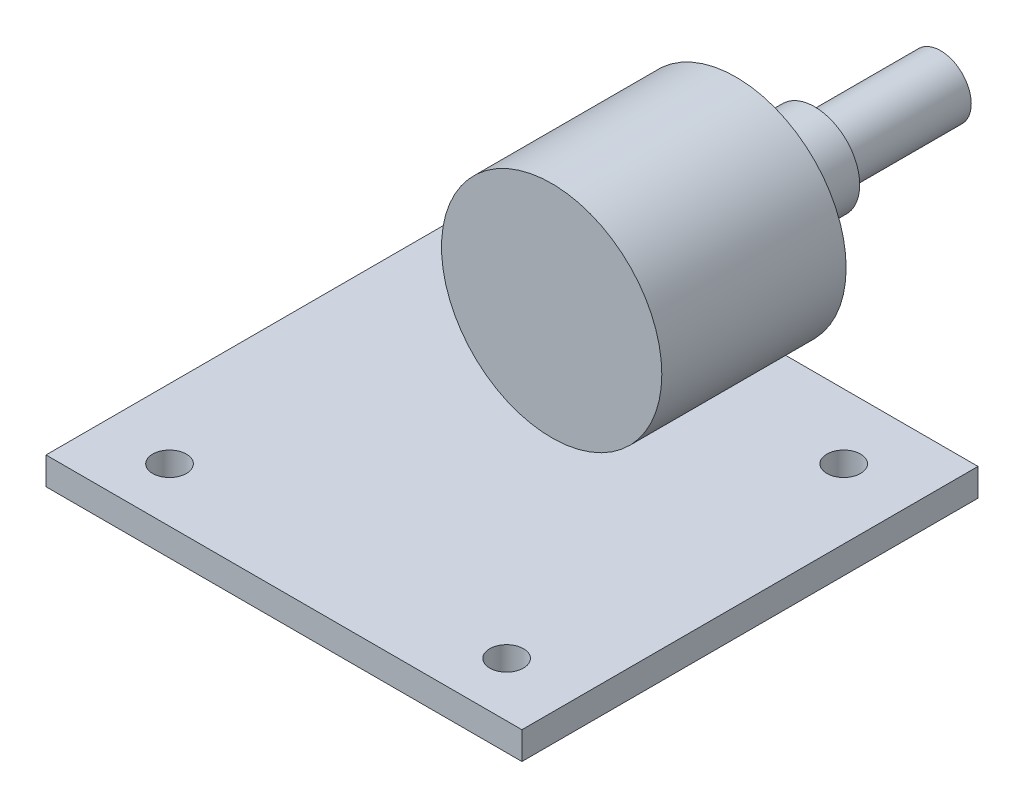
ISO-10303-21;
HEADER;
FILE_DESCRIPTION(('STEP AP214'),'2;1');
FILE_NAME('part.step','',(''),(''),'','','');
FILE_SCHEMA(('AUTOMOTIVE_DESIGN { 1 0 10303 214 1 1 1 1 }'));
ENDSEC;
DATA;
#1=APPLICATION_CONTEXT('core data for automotive mechanical design processes');
#2=APPLICATION_PROTOCOL_DEFINITION('international standard','automotive_design',2000,#1);
#3=PRODUCT_CONTEXT('',#1,'mechanical');
#4=PRODUCT('Part','Part','',(#3));
#5=PRODUCT_RELATED_PRODUCT_CATEGORY('part','',(#4));
#6=PRODUCT_DEFINITION_FORMATION('','',#4);
#7=PRODUCT_DEFINITION_CONTEXT('part definition',#1,'design');
#8=PRODUCT_DEFINITION('design','',#6,#7);
#9=PRODUCT_DEFINITION_SHAPE('','',#8);
#10=(LENGTH_UNIT() NAMED_UNIT(*) SI_UNIT(.MILLI.,.METRE.));
#11=(NAMED_UNIT(*) PLANE_ANGLE_UNIT() SI_UNIT($,.RADIAN.));
#12=(NAMED_UNIT(*) SI_UNIT($,.STERADIAN.) SOLID_ANGLE_UNIT());
#13=UNCERTAINTY_MEASURE_WITH_UNIT(LENGTH_MEASURE(1.E-05),#10,'distance_accuracy_value','');
#14=(GEOMETRIC_REPRESENTATION_CONTEXT(3) GLOBAL_UNCERTAINTY_ASSIGNED_CONTEXT((#13)) GLOBAL_UNIT_ASSIGNED_CONTEXT((#10,
#11,#12)) REPRESENTATION_CONTEXT('',''));
#15=CARTESIAN_POINT('',(0.,0.,0.));
#16=DIRECTION('',(0.,0.,1.));
#17=DIRECTION('',(1.,0.,0.));
#18=AXIS2_PLACEMENT_3D('',#15,#16,#17);
#19=CARTESIAN_POINT('',(-24.,-13.89,-19.));
#20=DIRECTION('',(0.,-1.,0.));
#21=DIRECTION('',(1.,0.,0.));
#22=AXIS2_PLACEMENT_3D('',#19,#20,#21);
#23=PLANE('',#22);
#24=DIRECTION('',(0.,0.,1.));
#25=VECTOR('',#24,1.);
#26=CARTESIAN_POINT('',(24.,-13.89,-19.));
#27=LINE('',#26,#25);
#28=CARTESIAN_POINT('',(24.,-13.89,-19.));
#29=VERTEX_POINT('',#28);
#30=CARTESIAN_POINT('',(24.,-13.89,27.));
#31=VERTEX_POINT('',#30);
#32=EDGE_CURVE('E88',#29,#31,#27,.T.);
#33=ORIENTED_EDGE('',*,*,#32,.T.);
#34=DIRECTION('',(1.,0.,0.));
#35=VECTOR('',#34,1.);
#36=CARTESIAN_POINT('',(-24.,-13.89,27.));
#37=LINE('',#36,#35);
#38=CARTESIAN_POINT('',(-24.,-13.89,27.));
#39=VERTEX_POINT('',#38);
#40=EDGE_CURVE('E91',#39,#31,#37,.T.);
#41=ORIENTED_EDGE('',*,*,#40,.F.);
#42=DIRECTION('',(0.,0.,1.));
#43=VECTOR('',#42,1.);
#44=CARTESIAN_POINT('',(-24.,-13.89,-19.));
#45=LINE('',#44,#43);
#46=CARTESIAN_POINT('',(-24.,-13.89,-19.));
#47=VERTEX_POINT('',#46);
#48=EDGE_CURVE('E46',#47,#39,#45,.T.);
#49=ORIENTED_EDGE('',*,*,#48,.F.);
#50=DIRECTION('',(1.,0.,0.));
#51=VECTOR('',#50,1.);
#52=CARTESIAN_POINT('',(-24.,-13.89,-19.));
#53=LINE('',#52,#51);
#54=EDGE_CURVE('E111',#47,#29,#53,.T.);
#55=ORIENTED_EDGE('',*,*,#54,.T.);
#56=EDGE_LOOP('',(#33,#41,#49,#55));
#57=FACE_BOUND('',#56,.T.);
#58=CARTESIAN_POINT('',(17.,-13.89,-12.4580000000001));
#59=DIRECTION('',(0.,1.,0.));
#60=DIRECTION('',(0.,0.,1.));
#61=AXIS2_PLACEMENT_3D('',#58,#59,#60);
#62=CIRCLE('',#61,1.7);
#63=CARTESIAN_POINT('',(17.,-13.89,-10.7580000000001));
#64=VERTEX_POINT('',#63);
#65=EDGE_CURVE('E101',#64,#64,#62,.T.);
#66=ORIENTED_EDGE('',*,*,#65,.T.);
#67=EDGE_LOOP('',(#66));
#68=FACE_BOUND('',#67,.T.);
#69=CARTESIAN_POINT('',(17.,-13.89,21.5419999999999));
#70=DIRECTION('',(0.,1.,0.));
#71=DIRECTION('',(0.,0.,1.));
#72=AXIS2_PLACEMENT_3D('',#69,#70,#71);
#73=CIRCLE('',#72,1.7);
#74=CARTESIAN_POINT('',(17.,-13.89,23.2419999999999));
#75=VERTEX_POINT('',#74);
#76=EDGE_CURVE('E156',#75,#75,#73,.T.);
#77=ORIENTED_EDGE('',*,*,#76,.T.);
#78=EDGE_LOOP('',(#77));
#79=FACE_BOUND('',#78,.T.);
#80=CARTESIAN_POINT('',(-17.,-13.89,21.5419999999999));
#81=DIRECTION('',(0.,1.,0.));
#82=DIRECTION('',(0.,0.,1.));
#83=AXIS2_PLACEMENT_3D('',#80,#81,#82);
#84=CIRCLE('',#83,1.7);
#85=CARTESIAN_POINT('',(-17.,-13.89,23.2419999999999));
#86=VERTEX_POINT('',#85);
#87=EDGE_CURVE('E161',#86,#86,#84,.T.);
#88=ORIENTED_EDGE('',*,*,#87,.T.);
#89=EDGE_LOOP('',(#88));
#90=FACE_BOUND('',#89,.T.);
#91=CARTESIAN_POINT('',(-17.,-13.89,-12.4580000000001));
#92=DIRECTION('',(0.,1.,0.));
#93=DIRECTION('',(0.,0.,1.));
#94=AXIS2_PLACEMENT_3D('',#91,#92,#93);
#95=CIRCLE('',#94,1.7);
#96=CARTESIAN_POINT('',(-17.,-13.89,-10.7580000000001));
#97=VERTEX_POINT('',#96);
#98=EDGE_CURVE('E165',#97,#97,#95,.T.);
#99=ORIENTED_EDGE('',*,*,#98,.T.);
#100=EDGE_LOOP('',(#99));
#101=FACE_BOUND('',#100,.T.);
#102=ADVANCED_FACE('F42',(#57,#68,#79,#90,#101),#23,.T.);
#103=CARTESIAN_POINT('',(-24.,-11.11,-19.));
#104=DIRECTION('',(-1.,0.,0.));
#105=DIRECTION('',(0.,0.,1.));
#106=AXIS2_PLACEMENT_3D('',#103,#104,#105);
#107=PLANE('',#106);
#108=ORIENTED_EDGE('',*,*,#48,.T.);
#109=DIRECTION('',(0.,-1.,0.));
#110=VECTOR('',#109,1.);
#111=CARTESIAN_POINT('',(-24.,-11.11,27.));
#112=LINE('',#111,#110);
#113=CARTESIAN_POINT('',(-24.,-11.11,27.));
#114=VERTEX_POINT('',#113);
#115=EDGE_CURVE('E83',#114,#39,#112,.T.);
#116=ORIENTED_EDGE('',*,*,#115,.F.);
#117=DIRECTION('',(0.,0.,1.));
#118=VECTOR('',#117,1.);
#119=CARTESIAN_POINT('',(-24.,-11.11,-19.));
#120=LINE('',#119,#118);
#121=CARTESIAN_POINT('',(-24.,-11.11,-19.));
#122=VERTEX_POINT('',#121);
#123=EDGE_CURVE('E12',#122,#114,#120,.T.);
#124=ORIENTED_EDGE('',*,*,#123,.F.);
#125=DIRECTION('',(0.,-1.,0.));
#126=VECTOR('',#125,1.);
#127=CARTESIAN_POINT('',(-24.,-11.11,-19.));
#128=LINE('',#127,#126);
#129=EDGE_CURVE('E84',#122,#47,#128,.T.);
#130=ORIENTED_EDGE('',*,*,#129,.T.);
#131=EDGE_LOOP('',(#108,#116,#124,#130));
#132=FACE_BOUND('',#131,.T.);
#133=ADVANCED_FACE('F44',(#132),#107,.T.);
#134=CARTESIAN_POINT('',(-24.,-11.11,-19.));
#135=DIRECTION('',(0.,1.,0.));
#136=DIRECTION('',(-1.,0.,0.));
#137=AXIS2_PLACEMENT_3D('',#134,#135,#136);
#138=PLANE('',#137);
#139=CARTESIAN_POINT('',(-17.,-11.11,-12.4580000000001));
#140=DIRECTION('',(0.,1.,0.));
#141=DIRECTION('',(0.,0.,1.));
#142=AXIS2_PLACEMENT_3D('',#139,#140,#141);
#143=CIRCLE('',#142,1.7);
#144=CARTESIAN_POINT('',(-17.,-11.11,-10.7580000000001));
#145=VERTEX_POINT('',#144);
#146=EDGE_CURVE('E144',#145,#145,#143,.T.);
#147=ORIENTED_EDGE('',*,*,#146,.F.);
#148=EDGE_LOOP('',(#147));
#149=FACE_BOUND('',#148,.T.);
#150=CARTESIAN_POINT('',(-17.,-11.11,21.5419999999999));
#151=DIRECTION('',(0.,1.,0.));
#152=DIRECTION('',(0.,0.,1.));
#153=AXIS2_PLACEMENT_3D('',#150,#151,#152);
#154=CIRCLE('',#153,1.7);
#155=CARTESIAN_POINT('',(-17.,-11.11,23.2419999999999));
#156=VERTEX_POINT('',#155);
#157=EDGE_CURVE('E148',#156,#156,#154,.T.);
#158=ORIENTED_EDGE('',*,*,#157,.F.);
#159=EDGE_LOOP('',(#158));
#160=FACE_BOUND('',#159,.T.);
#161=CARTESIAN_POINT('',(17.,-11.11,21.5419999999999));
#162=DIRECTION('',(0.,1.,0.));
#163=DIRECTION('',(0.,0.,1.));
#164=AXIS2_PLACEMENT_3D('',#161,#162,#163);
#165=CIRCLE('',#164,1.7);
#166=CARTESIAN_POINT('',(17.,-11.11,23.2419999999999));
#167=VERTEX_POINT('',#166);
#168=EDGE_CURVE('E152',#167,#167,#165,.T.);
#169=ORIENTED_EDGE('',*,*,#168,.F.);
#170=EDGE_LOOP('',(#169));
#171=FACE_BOUND('',#170,.T.);
#172=CARTESIAN_POINT('',(17.,-11.11,-12.4580000000001));
#173=DIRECTION('',(0.,1.,0.));
#174=DIRECTION('',(0.,0.,1.));
#175=AXIS2_PLACEMENT_3D('',#172,#173,#174);
#176=CIRCLE('',#175,1.7);
#177=CARTESIAN_POINT('',(17.,-11.11,-10.7580000000001));
#178=VERTEX_POINT('',#177);
#179=EDGE_CURVE('E104',#178,#178,#176,.T.);
#180=ORIENTED_EDGE('',*,*,#179,.F.);
#181=EDGE_LOOP('',(#180));
#182=FACE_BOUND('',#181,.T.);
#183=ORIENTED_EDGE('',*,*,#123,.T.);
#184=DIRECTION('',(-1.,0.,0.));
#185=VECTOR('',#184,1.);
#186=CARTESIAN_POINT('',(-24.,-11.11,27.));
#187=LINE('',#186,#185);
#188=CARTESIAN_POINT('',(24.,-11.11,27.));
#189=VERTEX_POINT('',#188);
#190=EDGE_CURVE('E100',#189,#114,#187,.T.);
#191=ORIENTED_EDGE('',*,*,#190,.F.);
#192=DIRECTION('',(0.,0.,1.));
#193=VECTOR('',#192,1.);
#194=CARTESIAN_POINT('',(24.,-11.11,-19.));
#195=LINE('',#194,#193);
#196=CARTESIAN_POINT('',(24.,-11.11,-19.));
#197=VERTEX_POINT('',#196);
#198=EDGE_CURVE('E51',#197,#189,#195,.T.);
#199=ORIENTED_EDGE('',*,*,#198,.F.);
#200=DIRECTION('',(-1.,0.,0.));
#201=VECTOR('',#200,1.);
#202=CARTESIAN_POINT('',(-24.,-11.11,-19.));
#203=LINE('',#202,#201);
#204=EDGE_CURVE('E89',#197,#122,#203,.T.);
#205=ORIENTED_EDGE('',*,*,#204,.T.);
#206=EDGE_LOOP('',(#183,#191,#199,#205));
#207=FACE_BOUND('',#206,.T.);
#208=ADVANCED_FACE('F120',(#149,#160,#171,#182,#207),#138,.T.);
#209=CARTESIAN_POINT('',(24.,-11.11,-19.));
#210=DIRECTION('',(1.,0.,0.));
#211=DIRECTION('',(0.,0.,-1.));
#212=AXIS2_PLACEMENT_3D('',#209,#210,#211);
#213=PLANE('',#212);
#214=ORIENTED_EDGE('',*,*,#198,.T.);
#215=DIRECTION('',(0.,1.,0.));
#216=VECTOR('',#215,1.);
#217=CARTESIAN_POINT('',(24.,-11.11,27.));
#218=LINE('',#217,#216);
#219=EDGE_CURVE('E96',#31,#189,#218,.T.);
#220=ORIENTED_EDGE('',*,*,#219,.F.);
#221=ORIENTED_EDGE('',*,*,#32,.F.);
#222=DIRECTION('',(0.,1.,0.));
#223=VECTOR('',#222,1.);
#224=CARTESIAN_POINT('',(24.,-11.11,-19.));
#225=LINE('',#224,#223);
#226=EDGE_CURVE('E113',#29,#197,#225,.T.);
#227=ORIENTED_EDGE('',*,*,#226,.T.);
#228=EDGE_LOOP('',(#214,#220,#221,#227));
#229=FACE_BOUND('',#228,.T.);
#230=ADVANCED_FACE('F117',(#229),#213,.T.);
#231=CARTESIAN_POINT('',(0.,0.,-19.));
#232=DIRECTION('',(0.,0.,1.));
#233=DIRECTION('',(1.,0.,0.));
#234=AXIS2_PLACEMENT_3D('',#231,#232,#233);
#235=PLANE('',#234);
#236=ORIENTED_EDGE('',*,*,#129,.F.);
#237=ORIENTED_EDGE('',*,*,#204,.F.);
#238=ORIENTED_EDGE('',*,*,#226,.F.);
#239=ORIENTED_EDGE('',*,*,#54,.F.);
#240=EDGE_LOOP('',(#236,#237,#238,#239));
#241=FACE_BOUND('',#240,.T.);
#242=ADVANCED_FACE('F122',(#241),#235,.F.);
#243=CARTESIAN_POINT('',(0.,0.,27.));
#244=DIRECTION('',(0.,0.,1.));
#245=DIRECTION('',(1.,0.,0.));
#246=AXIS2_PLACEMENT_3D('',#243,#244,#245);
#247=PLANE('',#246);
#248=ORIENTED_EDGE('',*,*,#115,.T.);
#249=ORIENTED_EDGE('',*,*,#40,.T.);
#250=ORIENTED_EDGE('',*,*,#219,.T.);
#251=ORIENTED_EDGE('',*,*,#190,.T.);
#252=EDGE_LOOP('',(#248,#249,#250,#251));
#253=FACE_BOUND('',#252,.T.);
#254=ADVANCED_FACE('F99',(#253),#247,.T.);
#255=CARTESIAN_POINT('',(17.,-11.11,-12.4580000000001));
#256=DIRECTION('',(0.,1.,0.));
#257=DIRECTION('',(0.,0.,1.));
#258=AXIS2_PLACEMENT_3D('',#255,#256,#257);
#259=CYLINDRICAL_SURFACE('',#258,1.7);
#260=ORIENTED_EDGE('',*,*,#65,.F.);
#261=EDGE_LOOP('',(#260));
#262=FACE_BOUND('',#261,.T.);
#263=ORIENTED_EDGE('',*,*,#179,.T.);
#264=EDGE_LOOP('',(#263));
#265=FACE_BOUND('',#264,.T.);
#266=ADVANCED_FACE('F129',(#262,#265),#259,.F.);
#267=CARTESIAN_POINT('',(17.,-11.11,21.5419999999999));
#268=DIRECTION('',(0.,1.,0.));
#269=DIRECTION('',(0.,0.,1.));
#270=AXIS2_PLACEMENT_3D('',#267,#268,#269);
#271=CYLINDRICAL_SURFACE('',#270,1.7);
#272=ORIENTED_EDGE('',*,*,#76,.F.);
#273=EDGE_LOOP('',(#272));
#274=FACE_BOUND('',#273,.T.);
#275=ORIENTED_EDGE('',*,*,#168,.T.);
#276=EDGE_LOOP('',(#275));
#277=FACE_BOUND('',#276,.T.);
#278=ADVANCED_FACE('F177',(#274,#277),#271,.F.);
#279=CARTESIAN_POINT('',(-17.,-11.11,21.5419999999999));
#280=DIRECTION('',(0.,1.,0.));
#281=DIRECTION('',(0.,0.,1.));
#282=AXIS2_PLACEMENT_3D('',#279,#280,#281);
#283=CYLINDRICAL_SURFACE('',#282,1.7);
#284=ORIENTED_EDGE('',*,*,#87,.F.);
#285=EDGE_LOOP('',(#284));
#286=FACE_BOUND('',#285,.T.);
#287=ORIENTED_EDGE('',*,*,#157,.T.);
#288=EDGE_LOOP('',(#287));
#289=FACE_BOUND('',#288,.T.);
#290=ADVANCED_FACE('F171',(#286,#289),#283,.F.);
#291=CARTESIAN_POINT('',(-17.,-11.11,-12.4580000000001));
#292=DIRECTION('',(0.,1.,0.));
#293=DIRECTION('',(0.,0.,1.));
#294=AXIS2_PLACEMENT_3D('',#291,#292,#293);
#295=CYLINDRICAL_SURFACE('',#294,1.7);
#296=ORIENTED_EDGE('',*,*,#98,.F.);
#297=EDGE_LOOP('',(#296));
#298=FACE_BOUND('',#297,.T.);
#299=ORIENTED_EDGE('',*,*,#146,.T.);
#300=EDGE_LOOP('',(#299));
#301=FACE_BOUND('',#300,.T.);
#302=ADVANCED_FACE('F169',(#298,#301),#295,.F.);
#303=CLOSED_SHELL('',(#102,#133,#208,#230,#242,#254,#266,#278,#290,#302));
#304=MANIFOLD_SOLID_BREP('B2',#303);
#305=CARTESIAN_POINT('',(0.,11.11,0.));
#306=DIRECTION('',(0.,0.,-1.));
#307=DIRECTION('',(-1.,0.,0.));
#308=AXIS2_PLACEMENT_3D('',#305,#306,#307);
#309=PLANE('',#308);
#310=CARTESIAN_POINT('',(0.,0.,0.));
#311=DIRECTION('',(0.,0.,1.));
#312=DIRECTION('',(1.,0.,0.));
#313=AXIS2_PLACEMENT_3D('',#310,#311,#312);
#314=CIRCLE('',#313,11.11);
#315=CARTESIAN_POINT('',(11.11,0.,0.));
#316=VERTEX_POINT('',#315);
#317=EDGE_CURVE('E283',#316,#316,#314,.T.);
#318=ORIENTED_EDGE('',*,*,#317,.T.);
#319=EDGE_LOOP('',(#318));
#320=FACE_BOUND('',#319,.T.);
#321=ADVANCED_FACE('F261',(#320),#309,.F.);
#322=CARTESIAN_POINT('',(0.,0.,-39.22));
#323=DIRECTION('',(0.,0.,1.));
#324=DIRECTION('',(1.,0.,0.));
#325=AXIS2_PLACEMENT_3D('',#322,#323,#324);
#326=PLANE('',#325);
#327=CARTESIAN_POINT('',(0.,0.,-39.22));
#328=DIRECTION('',(0.,0.,1.));
#329=DIRECTION('',(1.,0.,0.));
#330=AXIS2_PLACEMENT_3D('',#327,#328,#329);
#331=CIRCLE('',#330,3.1);
#332=CARTESIAN_POINT('',(3.1,0.,-39.22));
#333=VERTEX_POINT('',#332);
#334=EDGE_CURVE('E41',#333,#333,#331,.T.);
#335=ORIENTED_EDGE('',*,*,#334,.F.);
#336=EDGE_LOOP('',(#335));
#337=FACE_BOUND('',#336,.T.);
#338=ADVANCED_FACE('F313',(#337),#326,.F.);
#339=CARTESIAN_POINT('',(0.,0.,0.));
#340=DIRECTION('',(0.,0.,1.));
#341=DIRECTION('',(1.,0.,0.));
#342=AXIS2_PLACEMENT_3D('',#339,#340,#341);
#343=CYLINDRICAL_SURFACE('',#342,3.1);
#344=CARTESIAN_POINT('',(0.,0.,-26.52));
#345=DIRECTION('',(0.,0.,1.));
#346=DIRECTION('',(1.,0.,0.));
#347=AXIS2_PLACEMENT_3D('',#344,#345,#346);
#348=CIRCLE('',#347,3.1);
#349=CARTESIAN_POINT('',(3.1,0.,-26.52));
#350=VERTEX_POINT('',#349);
#351=EDGE_CURVE('E267',#350,#350,#348,.T.);
#352=ORIENTED_EDGE('',*,*,#351,.F.);
#353=EDGE_LOOP('',(#352));
#354=FACE_BOUND('',#353,.T.);
#355=ORIENTED_EDGE('',*,*,#334,.T.);
#356=EDGE_LOOP('',(#355));
#357=FACE_BOUND('',#356,.T.);
#358=ADVANCED_FACE('F308',(#354,#357),#343,.T.);
#359=CARTESIAN_POINT('',(0.,3.1,-26.52));
#360=DIRECTION('',(0.,0.,1.));
#361=DIRECTION('',(1.,0.,0.));
#362=AXIS2_PLACEMENT_3D('',#359,#360,#361);
#363=PLANE('',#362);
#364=CARTESIAN_POINT('',(0.,0.,-26.52));
#365=DIRECTION('',(0.,0.,1.));
#366=DIRECTION('',(1.,0.,0.));
#367=AXIS2_PLACEMENT_3D('',#364,#365,#366);
#368=CIRCLE('',#367,4.55);
#369=CARTESIAN_POINT('',(4.55,0.,-26.52));
#370=VERTEX_POINT('',#369);
#371=EDGE_CURVE('E271',#370,#370,#368,.T.);
#372=ORIENTED_EDGE('',*,*,#371,.F.);
#373=EDGE_LOOP('',(#372));
#374=FACE_BOUND('',#373,.T.);
#375=ORIENTED_EDGE('',*,*,#351,.T.);
#376=EDGE_LOOP('',(#375));
#377=FACE_BOUND('',#376,.T.);
#378=ADVANCED_FACE('F303',(#374,#377),#363,.F.);
#379=CARTESIAN_POINT('',(0.,0.,0.));
#380=DIRECTION('',(0.,0.,1.));
#381=DIRECTION('',(1.,0.,0.));
#382=AXIS2_PLACEMENT_3D('',#379,#380,#381);
#383=CYLINDRICAL_SURFACE('',#382,4.55);
#384=CARTESIAN_POINT('',(0.,0.,-18.59));
#385=DIRECTION('',(0.,0.,1.));
#386=DIRECTION('',(1.,0.,0.));
#387=AXIS2_PLACEMENT_3D('',#384,#385,#386);
#388=CIRCLE('',#387,4.55);
#389=CARTESIAN_POINT('',(4.55,0.,-18.59));
#390=VERTEX_POINT('',#389);
#391=EDGE_CURVE('E275',#390,#390,#388,.T.);
#392=ORIENTED_EDGE('',*,*,#391,.F.);
#393=EDGE_LOOP('',(#392));
#394=FACE_BOUND('',#393,.T.);
#395=ORIENTED_EDGE('',*,*,#371,.T.);
#396=EDGE_LOOP('',(#395));
#397=FACE_BOUND('',#396,.T.);
#398=ADVANCED_FACE('F297',(#394,#397),#383,.T.);
#399=CARTESIAN_POINT('',(0.,4.55,-18.59));
#400=DIRECTION('',(0.,0.,1.));
#401=DIRECTION('',(1.,0.,0.));
#402=AXIS2_PLACEMENT_3D('',#399,#400,#401);
#403=PLANE('',#402);
#404=CARTESIAN_POINT('',(0.,0.,-18.59));
#405=DIRECTION('',(0.,0.,1.));
#406=DIRECTION('',(1.,0.,0.));
#407=AXIS2_PLACEMENT_3D('',#404,#405,#406);
#408=CIRCLE('',#407,11.11);
#409=CARTESIAN_POINT('',(11.11,0.,-18.59));
#410=VERTEX_POINT('',#409);
#411=EDGE_CURVE('E280',#410,#410,#408,.T.);
#412=ORIENTED_EDGE('',*,*,#411,.F.);
#413=EDGE_LOOP('',(#412));
#414=FACE_BOUND('',#413,.T.);
#415=ORIENTED_EDGE('',*,*,#391,.T.);
#416=EDGE_LOOP('',(#415));
#417=FACE_BOUND('',#416,.T.);
#418=ADVANCED_FACE('F291',(#414,#417),#403,.F.);
#419=CARTESIAN_POINT('',(0.,0.,0.));
#420=DIRECTION('',(0.,0.,1.));
#421=DIRECTION('',(1.,0.,0.));
#422=AXIS2_PLACEMENT_3D('',#419,#420,#421);
#423=CYLINDRICAL_SURFACE('',#422,11.11);
#424=ORIENTED_EDGE('',*,*,#317,.F.);
#425=EDGE_LOOP('',(#424));
#426=FACE_BOUND('',#425,.T.);
#427=ORIENTED_EDGE('',*,*,#411,.T.);
#428=EDGE_LOOP('',(#427));
#429=FACE_BOUND('',#428,.T.);
#430=ADVANCED_FACE('F288',(#426,#429),#423,.T.);
#431=CLOSED_SHELL('',(#321,#338,#358,#378,#398,#418,#430));
#432=MANIFOLD_SOLID_BREP('B6',#431);
#433=ADVANCED_BREP_SHAPE_REPRESENTATION('',(#18,#304,#432),#14);
#434=SHAPE_DEFINITION_REPRESENTATION(#9,#433);
ENDSEC;
END-ISO-10303-21;
